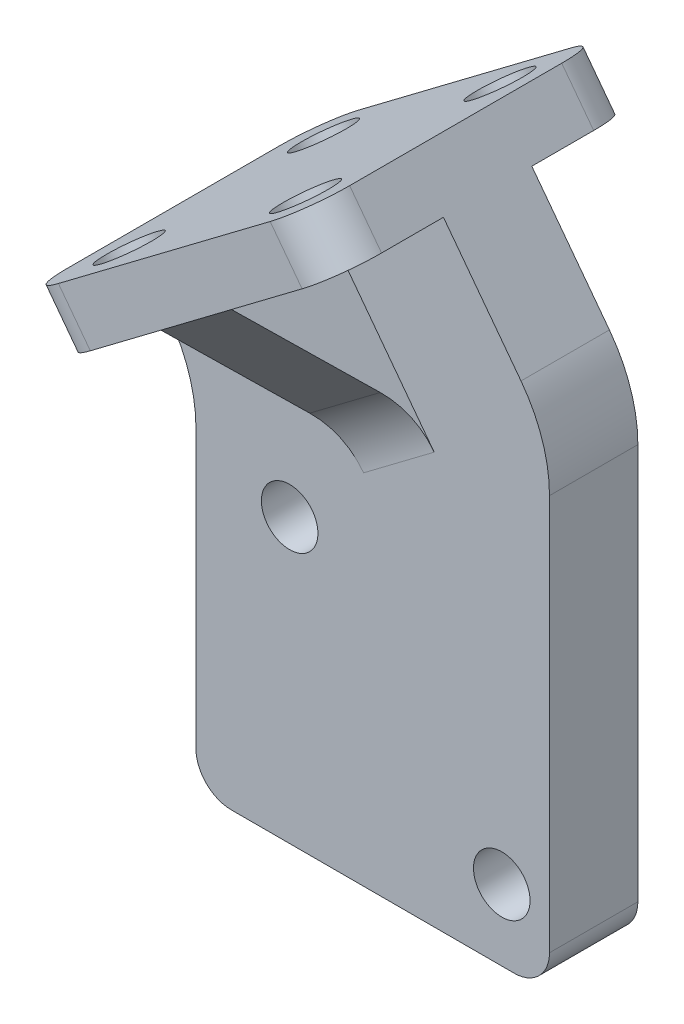
ISO-10303-21;
HEADER;
FILE_DESCRIPTION(('STEP AP214'),'2;1');
FILE_NAME('part.step','',(''),(''),'','','');
FILE_SCHEMA(('AUTOMOTIVE_DESIGN { 1 0 10303 214 1 1 1 1 }'));
ENDSEC;
DATA;
#1=APPLICATION_CONTEXT('core data for automotive mechanical design processes');
#2=APPLICATION_PROTOCOL_DEFINITION('international standard','automotive_design',2000,#1);
#3=PRODUCT_CONTEXT('',#1,'mechanical');
#4=PRODUCT('Part','Part','',(#3));
#5=PRODUCT_RELATED_PRODUCT_CATEGORY('part','',(#4));
#6=PRODUCT_DEFINITION_FORMATION('','',#4);
#7=PRODUCT_DEFINITION_CONTEXT('part definition',#1,'design');
#8=PRODUCT_DEFINITION('design','',#6,#7);
#9=PRODUCT_DEFINITION_SHAPE('','',#8);
#10=(LENGTH_UNIT() NAMED_UNIT(*) SI_UNIT(.MILLI.,.METRE.));
#11=(NAMED_UNIT(*) PLANE_ANGLE_UNIT() SI_UNIT($,.RADIAN.));
#12=(NAMED_UNIT(*) SI_UNIT($,.STERADIAN.) SOLID_ANGLE_UNIT());
#13=UNCERTAINTY_MEASURE_WITH_UNIT(LENGTH_MEASURE(1.E-05),#10,'distance_accuracy_value','');
#14=(GEOMETRIC_REPRESENTATION_CONTEXT(3) GLOBAL_UNCERTAINTY_ASSIGNED_CONTEXT((#13)) GLOBAL_UNIT_ASSIGNED_CONTEXT((#10,
#11,#12)) REPRESENTATION_CONTEXT('',''));
#15=CARTESIAN_POINT('',(0.,0.,0.));
#16=DIRECTION('',(0.,0.,1.));
#17=DIRECTION('',(1.,0.,0.));
#18=AXIS2_PLACEMENT_3D('',#15,#16,#17);
#19=CARTESIAN_POINT('',(0.023878574172298,24.5045375578801,8.5));
#20=DIRECTION('',(0.601815023152044,-0.798635510047296,0.));
#21=DIRECTION('',(0.798635510047296,0.601815023152044,0.));
#22=AXIS2_PLACEMENT_3D('',#19,#20,#21);
#23=PLANE('',#22);
#24=CARTESIAN_POINT('',(11.0051168373226,32.7794941262207,-3.));
#25=DIRECTION('',(-0.601815023152044,0.798635510047296,0.));
#26=DIRECTION('',(-0.798635510047296,-0.601815023152044,0.));
#27=AXIS2_PLACEMENT_3D('',#24,#25,#26);
#28=CIRCLE('',#27,1.60000000000001);
#29=CARTESIAN_POINT('',(9.72730002124695,31.8165900891774,-3.));
#30=VERTEX_POINT('',#29);
#31=EDGE_CURVE('E791',#30,#30,#28,.T.);
#32=ORIENTED_EDGE('',*,*,#31,.T.);
#33=EDGE_LOOP('',(#32));
#34=FACE_BOUND('',#33,.T.);
#35=DIRECTION('',(-0.798635510047296,-0.601815023152044,0.));
#36=VECTOR('',#35,1.);
#37=CARTESIAN_POINT('',(-1.97271020094593,23.,0.));
#38=LINE('',#37,#36);
#39=CARTESIAN_POINT('',(14.,35.0363004630409,0.));
#40=VERTEX_POINT('',#39);
#41=CARTESIAN_POINT('',(8.01023367464528,30.5226877894005,0.));
#42=VERTEX_POINT('',#41);
#43=EDGE_CURVE('E238',#40,#42,#38,.T.);
#44=ORIENTED_EDGE('',*,*,#43,.T.);
#45=DIRECTION('',(0.,0.,1.));
#46=VECTOR('',#45,1.);
#47=CARTESIAN_POINT('',(8.01023367464528,30.5226877894005,-6.));
#48=LINE('',#47,#46);
#49=CARTESIAN_POINT('',(8.01023367464528,30.5226877894005,-6.));
#50=VERTEX_POINT('',#49);
#51=EDGE_CURVE('E220',#50,#42,#48,.T.);
#52=ORIENTED_EDGE('',*,*,#51,.F.);
#53=DIRECTION('',(-0.798635510047296,-0.601815023152043,0.));
#54=VECTOR('',#53,1.);
#55=CARTESIAN_POINT('',(12.0034112248818,33.5317629051608,-6.));
#56=LINE('',#55,#54);
#57=CARTESIAN_POINT('',(12.0034112248818,33.5317629051608,-6.));
#58=VERTEX_POINT('',#57);
#59=EDGE_CURVE('E372',#58,#50,#56,.T.);
#60=ORIENTED_EDGE('',*,*,#59,.F.);
#61=CARTESIAN_POINT('',(12.0034112248818,33.5317629051608,-3.5));
#62=DIRECTION('',(-0.601815023152044,0.798635510047296,0.));
#63=DIRECTION('',(-0.798635510047296,-0.601815023152044,0.));
#64=AXIS2_PLACEMENT_3D('',#61,#62,#63);
#65=CIRCLE('',#64,2.5);
#66=CARTESIAN_POINT('',(14.,35.0363004630409,-3.5));
#67=VERTEX_POINT('',#66);
#68=EDGE_CURVE('E364',#67,#58,#65,.T.);
#69=ORIENTED_EDGE('',*,*,#68,.F.);
#70=DIRECTION('',(0.,0.,-1.));
#71=VECTOR('',#70,1.);
#72=CARTESIAN_POINT('',(14.,35.0363004630409,8.5));
#73=LINE('',#72,#71);
#74=EDGE_CURVE('E365',#40,#67,#73,.T.);
#75=ORIENTED_EDGE('',*,*,#74,.F.);
#76=EDGE_LOOP('',(#44,#52,#60,#69,#75));
#77=FACE_BOUND('',#76,.T.);
#78=ADVANCED_FACE('F35',(#34,#77),#23,.T.);
#79=CARTESIAN_POINT('',(12.,24.3972689773018,5.));
#80=DIRECTION('',(0.,0.,-1.));
#81=DIRECTION('',(-1.,0.,0.));
#82=AXIS2_PLACEMENT_3D('',#79,#80,#81);
#83=PLANE('',#82);
#84=CARTESIAN_POINT('',(17.3,4.,5.));
#85=DIRECTION('',(0.,0.,1.));
#86=DIRECTION('',(1.,0.,0.));
#87=AXIS2_PLACEMENT_3D('',#84,#85,#86);
#88=CIRCLE('',#87,1.6);
#89=CARTESIAN_POINT('',(18.9,4.,5.));
#90=VERTEX_POINT('',#89);
#91=EDGE_CURVE('E404',#90,#90,#88,.T.);
#92=ORIENTED_EDGE('',*,*,#91,.F.);
#93=EDGE_LOOP('',(#92));
#94=FACE_BOUND('',#93,.T.);
#95=CARTESIAN_POINT('',(5.3,16.,5.));
#96=DIRECTION('',(0.,0.,1.));
#97=DIRECTION('',(1.,0.,0.));
#98=AXIS2_PLACEMENT_3D('',#95,#96,#97);
#99=CIRCLE('',#98,1.6);
#100=CARTESIAN_POINT('',(6.9,16.,5.));
#101=VERTEX_POINT('',#100);
#102=EDGE_CURVE('E239',#101,#101,#99,.T.);
#103=ORIENTED_EDGE('',*,*,#102,.F.);
#104=EDGE_LOOP('',(#103));
#105=FACE_BOUND('',#104,.T.);
#106=DIRECTION('',(-0.601815023152044,0.798635510047296,0.));
#107=VECTOR('',#106,1.);
#108=CARTESIAN_POINT('',(8.01023367464528,30.5226877894005,5.));
#109=LINE('',#108,#107);
#110=CARTESIAN_POINT('',(13.4780280690126,23.2666795526702,5.));
#111=VERTEX_POINT('',#110);
#112=CARTESIAN_POINT('',(8.01023367464528,30.5226877894005,5.));
#113=VERTEX_POINT('',#112);
#114=EDGE_CURVE('E50',#111,#113,#109,.T.);
#115=ORIENTED_EDGE('',*,*,#114,.F.);
#116=DIRECTION('',(0.798635510047296,0.601815023152044,0.));
#117=VECTOR('',#116,1.);
#118=CARTESIAN_POINT('',(13.0787103139889,22.9657720410942,5.));
#119=LINE('',#118,#117);
#120=CARTESIAN_POINT('',(9.4848505187761,20.25760443691,5.));
#121=VERTEX_POINT('',#120);
#122=EDGE_CURVE('E299',#111,#121,#119,.F.);
#123=ORIENTED_EDGE('',*,*,#122,.T.);
#124=DIRECTION('',(-0.601815023152044,0.798635510047296,0.));
#125=VECTOR('',#124,1.);
#126=CARTESIAN_POINT('',(4.0170561244088,27.5136126736403,5.));
#127=LINE('',#126,#125);
#128=CARTESIAN_POINT('',(4.0170561244088,27.5136126736403,5.));
#129=VERTEX_POINT('',#128);
#130=EDGE_CURVE('E57',#121,#129,#127,.T.);
#131=ORIENTED_EDGE('',*,*,#130,.T.);
#132=DIRECTION('',(-0.798635510047296,-0.601815023152044,0.));
#133=VECTOR('',#132,1.);
#134=CARTESIAN_POINT('',(-1.97271020094593,23.,5.));
#135=LINE('',#134,#133);
#136=CARTESIAN_POINT('',(-1.97271020094593,23.,5.));
#137=VERTEX_POINT('',#136);
#138=EDGE_CURVE('E267',#129,#137,#135,.T.);
#139=ORIENTED_EDGE('',*,*,#138,.T.);
#140=DIRECTION('',(0.601815023152043,-0.798635510047297,0.));
#141=VECTOR('',#140,1.);
#142=CARTESIAN_POINT('',(-1.61091591962163,22.5198827724767,5.));
#143=LINE('',#142,#141);
#144=CARTESIAN_POINT('',(-1.61091591962163,22.5198827724767,5.));
#145=VERTEX_POINT('',#144);
#146=EDGE_CURVE('E329',#137,#145,#143,.T.);
#147=ORIENTED_EDGE('',*,*,#146,.T.);
#148=CARTESIAN_POINT('',(-8.,17.7053625872604,5.));
#149=DIRECTION('',(0.,0.,-1.));
#150=DIRECTION('',(1.,0.,0.));
#151=AXIS2_PLACEMENT_3D('',#148,#149,#150);
#152=CIRCLE('',#151,8.);
#153=CARTESIAN_POINT('',(0.,17.7053625872604,5.));
#154=VERTEX_POINT('',#153);
#155=EDGE_CURVE('E333',#145,#154,#152,.T.);
#156=ORIENTED_EDGE('',*,*,#155,.T.);
#157=DIRECTION('',(0.,-1.,0.));
#158=VECTOR('',#157,1.);
#159=CARTESIAN_POINT('',(0.,2.00000000000001,5.));
#160=LINE('',#159,#158);
#161=CARTESIAN_POINT('',(0.,2.00000000000001,5.));
#162=VERTEX_POINT('',#161);
#163=EDGE_CURVE('E335',#154,#162,#160,.T.);
#164=ORIENTED_EDGE('',*,*,#163,.T.);
#165=CARTESIAN_POINT('',(2.,2.,5.));
#166=DIRECTION('',(0.,0.,1.));
#167=DIRECTION('',(1.,0.,0.));
#168=AXIS2_PLACEMENT_3D('',#165,#166,#167);
#169=CIRCLE('',#168,2.);
#170=CARTESIAN_POINT('',(2.00000000000001,0.,5.));
#171=VERTEX_POINT('',#170);
#172=EDGE_CURVE('E337',#162,#171,#169,.T.);
#173=ORIENTED_EDGE('',*,*,#172,.T.);
#174=DIRECTION('',(1.,0.,0.));
#175=VECTOR('',#174,1.);
#176=CARTESIAN_POINT('',(18.,0.,5.));
#177=LINE('',#176,#175);
#178=CARTESIAN_POINT('',(18.,0.,5.));
#179=VERTEX_POINT('',#178);
#180=EDGE_CURVE('E339',#171,#179,#177,.T.);
#181=ORIENTED_EDGE('',*,*,#180,.T.);
#182=CARTESIAN_POINT('',(18.,2.,5.));
#183=DIRECTION('',(0.,0.,1.));
#184=DIRECTION('',(-1.,0.,0.));
#185=AXIS2_PLACEMENT_3D('',#182,#183,#184);
#186=CIRCLE('',#185,2.);
#187=CARTESIAN_POINT('',(20.,2.00000000000001,5.));
#188=VERTEX_POINT('',#187);
#189=EDGE_CURVE('E341',#179,#188,#186,.T.);
#190=ORIENTED_EDGE('',*,*,#189,.T.);
#191=DIRECTION('',(0.,1.,0.));
#192=VECTOR('',#191,1.);
#193=CARTESIAN_POINT('',(20.,24.3972689773018,5.));
#194=LINE('',#193,#192);
#195=CARTESIAN_POINT('',(20.,24.3972689773018,5.));
#196=VERTEX_POINT('',#195);
#197=EDGE_CURVE('E343',#188,#196,#194,.T.);
#198=ORIENTED_EDGE('',*,*,#197,.T.);
#199=CARTESIAN_POINT('',(12.,24.3972689773018,5.));
#200=DIRECTION('',(0.,0.,1.));
#201=DIRECTION('',(-1.,0.,0.));
#202=AXIS2_PLACEMENT_3D('',#199,#200,#201);
#203=CIRCLE('',#202,8.);
#204=CARTESIAN_POINT('',(18.3890840803784,29.2117891625181,5.));
#205=VERTEX_POINT('',#204);
#206=EDGE_CURVE('E344',#196,#205,#203,.T.);
#207=ORIENTED_EDGE('',*,*,#206,.T.);
#208=DIRECTION('',(-0.601815023152044,0.798635510047296,0.));
#209=VECTOR('',#208,1.);
#210=CARTESIAN_POINT('',(14.,35.0363004630409,5.));
#211=LINE('',#210,#209);
#212=CARTESIAN_POINT('',(14.,35.0363004630409,5.));
#213=VERTEX_POINT('',#212);
#214=EDGE_CURVE('E247',#205,#213,#211,.T.);
#215=ORIENTED_EDGE('',*,*,#214,.T.);
#216=EDGE_CURVE('E327',#213,#113,#135,.T.);
#217=ORIENTED_EDGE('',*,*,#216,.T.);
#218=EDGE_LOOP('',(#115,#123,#131,#139,#147,#156,#164,#173,#181,#190,#198,#207,#215,#217));
#219=FACE_BOUND('',#218,.T.);
#220=ADVANCED_FACE('F313',(#94,#105,#219),#83,.F.);
#221=CARTESIAN_POINT('',(1.02217296173143,25.2568063368202,8.));
#222=DIRECTION('',(-0.601815023152044,0.798635510047296,0.));
#223=DIRECTION('',(-0.798635510047296,-0.601815023152044,0.));
#224=AXIS2_PLACEMENT_3D('',#221,#222,#223);
#225=CIRCLE('',#224,1.6);
#226=CARTESIAN_POINT('',(-0.255643854344243,24.2939022997769,8.));
#227=VERTEX_POINT('',#226);
#228=EDGE_CURVE('E781',#227,#227,#225,.T.);
#229=ORIENTED_EDGE('',*,*,#228,.T.);
#230=EDGE_LOOP('',(#229));
#231=FACE_BOUND('',#230,.T.);
#232=ORIENTED_EDGE('',*,*,#138,.F.);
#233=DIRECTION('',(0.,0.,1.));
#234=VECTOR('',#233,1.);
#235=CARTESIAN_POINT('',(4.0170561244088,27.5136126736403,5.));
#236=LINE('',#235,#234);
#237=CARTESIAN_POINT('',(4.0170561244088,27.5136126736403,11.));
#238=VERTEX_POINT('',#237);
#239=EDGE_CURVE('E323',#129,#238,#236,.T.);
#240=ORIENTED_EDGE('',*,*,#239,.T.);
#241=DIRECTION('',(0.798635510047296,0.601815023152043,0.));
#242=VECTOR('',#241,1.);
#243=CARTESIAN_POINT('',(12.0034112248818,33.5317629051608,11.));
#244=LINE('',#243,#242);
#245=CARTESIAN_POINT('',(0.023878574172298,24.5045375578801,11.));
#246=VERTEX_POINT('',#245);
#247=EDGE_CURVE('E819',#246,#238,#244,.T.);
#248=ORIENTED_EDGE('',*,*,#247,.F.);
#249=CARTESIAN_POINT('',(0.023878574172298,24.5045375578801,8.5));
#250=DIRECTION('',(-0.601815023152044,0.798635510047296,0.));
#251=DIRECTION('',(0.798635510047296,0.601815023152044,0.));
#252=AXIS2_PLACEMENT_3D('',#249,#250,#251);
#253=CIRCLE('',#252,2.5);
#254=CARTESIAN_POINT('',(-1.97271020094594,23.,8.5));
#255=VERTEX_POINT('',#254);
#256=EDGE_CURVE('E802',#255,#246,#253,.T.);
#257=ORIENTED_EDGE('',*,*,#256,.F.);
#258=DIRECTION('',(0.,0.,1.));
#259=VECTOR('',#258,1.);
#260=CARTESIAN_POINT('',(-1.97271020094594,23.,8.5));
#261=LINE('',#260,#259);
#262=EDGE_CURVE('E326',#137,#255,#261,.T.);
#263=ORIENTED_EDGE('',*,*,#262,.F.);
#264=EDGE_LOOP('',(#232,#240,#248,#257,#263));
#265=FACE_BOUND('',#264,.T.);
#266=ADVANCED_FACE('F322',(#231,#265),#23,.T.);
#267=CARTESIAN_POINT('',(12.,24.3972689773018,0.));
#268=DIRECTION('',(0.,0.,-1.));
#269=DIRECTION('',(-1.,0.,0.));
#270=AXIS2_PLACEMENT_3D('',#267,#268,#269);
#271=PLANE('',#270);
#272=DIRECTION('',(0.798635510047296,0.601815023152044,0.));
#273=VECTOR('',#272,1.);
#274=CARTESIAN_POINT('',(13.4780280690126,23.2666795526702,0.));
#275=LINE('',#274,#273);
#276=CARTESIAN_POINT('',(9.4848505187761,20.25760443691,0.));
#277=VERTEX_POINT('',#276);
#278=CARTESIAN_POINT('',(13.4780280690126,23.2666795526702,0.));
#279=VERTEX_POINT('',#278);
#280=EDGE_CURVE('E292',#277,#279,#275,.T.);
#281=ORIENTED_EDGE('',*,*,#280,.T.);
#282=DIRECTION('',(0.601815023152044,-0.798635510047296,0.));
#283=VECTOR('',#282,1.);
#284=CARTESIAN_POINT('',(8.01023367464528,30.5226877894005,0.));
#285=LINE('',#284,#283);
#286=EDGE_CURVE('E832',#42,#279,#285,.T.);
#287=ORIENTED_EDGE('',*,*,#286,.F.);
#288=ORIENTED_EDGE('',*,*,#43,.F.);
#289=DIRECTION('',(-0.601815023152044,0.798635510047296,0.));
#290=VECTOR('',#289,1.);
#291=CARTESIAN_POINT('',(14.,35.0363004630409,0.));
#292=LINE('',#291,#290);
#293=CARTESIAN_POINT('',(18.3890840803784,29.2117891625181,0.));
#294=VERTEX_POINT('',#293);
#295=EDGE_CURVE('E264',#294,#40,#292,.T.);
#296=ORIENTED_EDGE('',*,*,#295,.F.);
#297=CARTESIAN_POINT('',(12.,24.3972689773018,0.));
#298=DIRECTION('',(0.,0.,1.));
#299=DIRECTION('',(-1.,0.,0.));
#300=AXIS2_PLACEMENT_3D('',#297,#298,#299);
#301=CIRCLE('',#300,8.);
#302=CARTESIAN_POINT('',(20.,24.3972689773018,0.));
#303=VERTEX_POINT('',#302);
#304=EDGE_CURVE('E262',#303,#294,#301,.T.);
#305=ORIENTED_EDGE('',*,*,#304,.F.);
#306=DIRECTION('',(0.,1.,0.));
#307=VECTOR('',#306,1.);
#308=CARTESIAN_POINT('',(20.,24.3972689773018,0.));
#309=LINE('',#308,#307);
#310=CARTESIAN_POINT('',(20.,2.00000000000001,0.));
#311=VERTEX_POINT('',#310);
#312=EDGE_CURVE('E260',#311,#303,#309,.T.);
#313=ORIENTED_EDGE('',*,*,#312,.F.);
#314=CARTESIAN_POINT('',(18.,2.,0.));
#315=DIRECTION('',(0.,0.,1.));
#316=DIRECTION('',(-1.,0.,0.));
#317=AXIS2_PLACEMENT_3D('',#314,#315,#316);
#318=CIRCLE('',#317,2.);
#319=CARTESIAN_POINT('',(18.,0.,0.));
#320=VERTEX_POINT('',#319);
#321=EDGE_CURVE('E258',#320,#311,#318,.T.);
#322=ORIENTED_EDGE('',*,*,#321,.F.);
#323=DIRECTION('',(1.,0.,0.));
#324=VECTOR('',#323,1.);
#325=CARTESIAN_POINT('',(18.,0.,0.));
#326=LINE('',#325,#324);
#327=CARTESIAN_POINT('',(2.00000000000001,0.,0.));
#328=VERTEX_POINT('',#327);
#329=EDGE_CURVE('E256',#328,#320,#326,.T.);
#330=ORIENTED_EDGE('',*,*,#329,.F.);
#331=CARTESIAN_POINT('',(2.,2.,0.));
#332=DIRECTION('',(0.,0.,1.));
#333=DIRECTION('',(1.,0.,0.));
#334=AXIS2_PLACEMENT_3D('',#331,#332,#333);
#335=CIRCLE('',#334,2.);
#336=CARTESIAN_POINT('',(0.,2.00000000000001,0.));
#337=VERTEX_POINT('',#336);
#338=EDGE_CURVE('E254',#337,#328,#335,.T.);
#339=ORIENTED_EDGE('',*,*,#338,.F.);
#340=DIRECTION('',(0.,-1.,0.));
#341=VECTOR('',#340,1.);
#342=CARTESIAN_POINT('',(0.,2.00000000000001,0.));
#343=LINE('',#342,#341);
#344=CARTESIAN_POINT('',(0.,17.7053625872604,0.));
#345=VERTEX_POINT('',#344);
#346=EDGE_CURVE('E252',#345,#337,#343,.T.);
#347=ORIENTED_EDGE('',*,*,#346,.F.);
#348=CARTESIAN_POINT('',(-8.,17.7053625872604,0.));
#349=DIRECTION('',(0.,0.,-1.));
#350=DIRECTION('',(1.,0.,0.));
#351=AXIS2_PLACEMENT_3D('',#348,#349,#350);
#352=CIRCLE('',#351,8.);
#353=CARTESIAN_POINT('',(-1.61091591962163,22.5198827724767,0.));
#354=VERTEX_POINT('',#353);
#355=EDGE_CURVE('E250',#354,#345,#352,.T.);
#356=ORIENTED_EDGE('',*,*,#355,.F.);
#357=DIRECTION('',(0.601815023152043,-0.798635510047297,0.));
#358=VECTOR('',#357,1.);
#359=CARTESIAN_POINT('',(-1.61091591962163,22.5198827724767,0.));
#360=LINE('',#359,#358);
#361=CARTESIAN_POINT('',(-1.97271020094593,23.,0.));
#362=VERTEX_POINT('',#361);
#363=EDGE_CURVE('E236',#362,#354,#360,.T.);
#364=ORIENTED_EDGE('',*,*,#363,.F.);
#365=CARTESIAN_POINT('',(4.0170561244088,27.5136126736403,0.));
#366=VERTEX_POINT('',#365);
#367=EDGE_CURVE('E226',#366,#362,#38,.T.);
#368=ORIENTED_EDGE('',*,*,#367,.F.);
#369=DIRECTION('',(0.601815023152044,-0.798635510047296,0.));
#370=VECTOR('',#369,1.);
#371=CARTESIAN_POINT('',(4.0170561244088,27.5136126736403,0.));
#372=LINE('',#371,#370);
#373=EDGE_CURVE('E207',#366,#277,#372,.T.);
#374=ORIENTED_EDGE('',*,*,#373,.T.);
#375=EDGE_LOOP('',(#281,#287,#288,#296,#305,#313,#322,#330,#339,#347,#356,#364,#368,#374));
#376=FACE_BOUND('',#375,.T.);
#377=CARTESIAN_POINT('',(5.3,16.,0.));
#378=DIRECTION('',(0.,0.,1.));
#379=DIRECTION('',(1.,0.,0.));
#380=AXIS2_PLACEMENT_3D('',#377,#378,#379);
#381=CIRCLE('',#380,1.6);
#382=CARTESIAN_POINT('',(6.9,16.,0.));
#383=VERTEX_POINT('',#382);
#384=EDGE_CURVE('E243',#383,#383,#381,.T.);
#385=ORIENTED_EDGE('',*,*,#384,.T.);
#386=EDGE_LOOP('',(#385));
#387=FACE_BOUND('',#386,.T.);
#388=CARTESIAN_POINT('',(17.3,4.,0.));
#389=DIRECTION('',(0.,0.,1.));
#390=DIRECTION('',(1.,0.,0.));
#391=AXIS2_PLACEMENT_3D('',#388,#389,#390);
#392=CIRCLE('',#391,1.6);
#393=CARTESIAN_POINT('',(18.9,4.,0.));
#394=VERTEX_POINT('',#393);
#395=EDGE_CURVE('E403',#394,#394,#392,.T.);
#396=ORIENTED_EDGE('',*,*,#395,.T.);
#397=EDGE_LOOP('',(#396));
#398=FACE_BOUND('',#397,.T.);
#399=ADVANCED_FACE('F233',(#376,#387,#398),#271,.T.);
#400=CARTESIAN_POINT('',(-1.61091591962163,22.5198827724767,5.));
#401=DIRECTION('',(0.798635510047297,0.601815023152043,0.));
#402=DIRECTION('',(-0.601815023152043,0.798635510047297,0.));
#403=AXIS2_PLACEMENT_3D('',#400,#401,#402);
#404=PLANE('',#403);
#405=ORIENTED_EDGE('',*,*,#363,.T.);
#406=DIRECTION('',(0.,0.,-1.));
#407=VECTOR('',#406,1.);
#408=CARTESIAN_POINT('',(-1.61091591962163,22.5198827724767,5.));
#409=LINE('',#408,#407);
#410=EDGE_CURVE('E289',#145,#354,#409,.T.);
#411=ORIENTED_EDGE('',*,*,#410,.F.);
#412=ORIENTED_EDGE('',*,*,#146,.F.);
#413=ORIENTED_EDGE('',*,*,#262,.T.);
#414=DIRECTION('',(0.601815023152043,-0.798635510047296,0.));
#415=VECTOR('',#414,1.);
#416=CARTESIAN_POINT('',(-3.77815527040207,25.3959065301419,8.5));
#417=LINE('',#416,#415);
#418=CARTESIAN_POINT('',(-3.77815527040207,25.3959065301419,8.5));
#419=VERTEX_POINT('',#418);
#420=EDGE_CURVE('E380',#419,#255,#417,.T.);
#421=ORIENTED_EDGE('',*,*,#420,.F.);
#422=DIRECTION('',(0.,0.,1.));
#423=VECTOR('',#422,1.);
#424=CARTESIAN_POINT('',(-3.77815527040207,25.3959065301419,8.5));
#425=LINE('',#424,#423);
#426=CARTESIAN_POINT('',(-3.77815527040207,25.3959065301419,-3.5));
#427=VERTEX_POINT('',#426);
#428=EDGE_CURVE('E384',#427,#419,#425,.T.);
#429=ORIENTED_EDGE('',*,*,#428,.F.);
#430=DIRECTION('',(0.601815023152043,-0.798635510047296,0.));
#431=VECTOR('',#430,1.);
#432=CARTESIAN_POINT('',(-3.77815527040207,25.3959065301419,-3.5));
#433=LINE('',#432,#431);
#434=CARTESIAN_POINT('',(-1.97271020094594,23.,-3.5));
#435=VERTEX_POINT('',#434);
#436=EDGE_CURVE('E383',#427,#435,#433,.T.);
#437=ORIENTED_EDGE('',*,*,#436,.T.);
#438=EDGE_CURVE('E377',#435,#362,#261,.T.);
#439=ORIENTED_EDGE('',*,*,#438,.T.);
#440=EDGE_LOOP('',(#405,#411,#412,#413,#421,#429,#437,#439));
#441=FACE_BOUND('',#440,.T.);
#442=ADVANCED_FACE('F646',(#441),#404,.F.);
#443=CARTESIAN_POINT('',(-8.,17.7053625872604,5.));
#444=DIRECTION('',(0.,0.,-1.));
#445=DIRECTION('',(-1.,0.,0.));
#446=AXIS2_PLACEMENT_3D('',#443,#444,#445);
#447=CYLINDRICAL_SURFACE('',#446,8.);
#448=ORIENTED_EDGE('',*,*,#355,.T.);
#449=DIRECTION('',(0.,0.,-1.));
#450=VECTOR('',#449,1.);
#451=CARTESIAN_POINT('',(0.,17.7053625872604,5.));
#452=LINE('',#451,#450);
#453=EDGE_CURVE('E286',#154,#345,#452,.T.);
#454=ORIENTED_EDGE('',*,*,#453,.F.);
#455=ORIENTED_EDGE('',*,*,#155,.F.);
#456=ORIENTED_EDGE('',*,*,#410,.T.);
#457=EDGE_LOOP('',(#448,#454,#455,#456));
#458=FACE_BOUND('',#457,.T.);
#459=ADVANCED_FACE('F652',(#458),#447,.F.);
#460=CARTESIAN_POINT('',(0.,2.00000000000001,5.));
#461=DIRECTION('',(1.,0.,0.));
#462=DIRECTION('',(0.,1.,0.));
#463=AXIS2_PLACEMENT_3D('',#460,#461,#462);
#464=PLANE('',#463);
#465=ORIENTED_EDGE('',*,*,#346,.T.);
#466=DIRECTION('',(0.,0.,-1.));
#467=VECTOR('',#466,1.);
#468=CARTESIAN_POINT('',(0.,2.00000000000001,5.));
#469=LINE('',#468,#467);
#470=EDGE_CURVE('E283',#162,#337,#469,.T.);
#471=ORIENTED_EDGE('',*,*,#470,.F.);
#472=ORIENTED_EDGE('',*,*,#163,.F.);
#473=ORIENTED_EDGE('',*,*,#453,.T.);
#474=EDGE_LOOP('',(#465,#471,#472,#473));
#475=FACE_BOUND('',#474,.T.);
#476=ADVANCED_FACE('F712',(#475),#464,.F.);
#477=CARTESIAN_POINT('',(2.,2.,5.));
#478=DIRECTION('',(0.,0.,-1.));
#479=DIRECTION('',(-1.,0.,0.));
#480=AXIS2_PLACEMENT_3D('',#477,#478,#479);
#481=CYLINDRICAL_SURFACE('',#480,2.);
#482=ORIENTED_EDGE('',*,*,#338,.T.);
#483=DIRECTION('',(0.,0.,-1.));
#484=VECTOR('',#483,1.);
#485=CARTESIAN_POINT('',(2.00000000000001,0.,5.));
#486=LINE('',#485,#484);
#487=EDGE_CURVE('E280',#171,#328,#486,.T.);
#488=ORIENTED_EDGE('',*,*,#487,.F.);
#489=ORIENTED_EDGE('',*,*,#172,.F.);
#490=ORIENTED_EDGE('',*,*,#470,.T.);
#491=EDGE_LOOP('',(#482,#488,#489,#490));
#492=FACE_BOUND('',#491,.T.);
#493=ADVANCED_FACE('F702',(#492),#481,.T.);
#494=CARTESIAN_POINT('',(18.,0.,5.));
#495=DIRECTION('',(0.,1.,0.));
#496=DIRECTION('',(0.,0.,1.));
#497=AXIS2_PLACEMENT_3D('',#494,#495,#496);
#498=PLANE('',#497);
#499=ORIENTED_EDGE('',*,*,#329,.T.);
#500=DIRECTION('',(0.,0.,-1.));
#501=VECTOR('',#500,1.);
#502=CARTESIAN_POINT('',(18.,0.,5.));
#503=LINE('',#502,#501);
#504=EDGE_CURVE('E277',#179,#320,#503,.T.);
#505=ORIENTED_EDGE('',*,*,#504,.F.);
#506=ORIENTED_EDGE('',*,*,#180,.F.);
#507=ORIENTED_EDGE('',*,*,#487,.T.);
#508=EDGE_LOOP('',(#499,#505,#506,#507));
#509=FACE_BOUND('',#508,.T.);
#510=ADVANCED_FACE('F692',(#509),#498,.F.);
#511=CARTESIAN_POINT('',(18.,2.,5.));
#512=DIRECTION('',(0.,0.,-1.));
#513=DIRECTION('',(-1.,0.,0.));
#514=AXIS2_PLACEMENT_3D('',#511,#512,#513);
#515=CYLINDRICAL_SURFACE('',#514,2.);
#516=ORIENTED_EDGE('',*,*,#321,.T.);
#517=DIRECTION('',(0.,0.,-1.));
#518=VECTOR('',#517,1.);
#519=CARTESIAN_POINT('',(20.,2.00000000000001,5.));
#520=LINE('',#519,#518);
#521=EDGE_CURVE('E274',#188,#311,#520,.T.);
#522=ORIENTED_EDGE('',*,*,#521,.F.);
#523=ORIENTED_EDGE('',*,*,#189,.F.);
#524=ORIENTED_EDGE('',*,*,#504,.T.);
#525=EDGE_LOOP('',(#516,#522,#523,#524));
#526=FACE_BOUND('',#525,.T.);
#527=ADVANCED_FACE('F682',(#526),#515,.T.);
#528=CARTESIAN_POINT('',(20.,24.3972689773018,5.));
#529=DIRECTION('',(-1.,0.,0.));
#530=DIRECTION('',(0.,-1.,0.));
#531=AXIS2_PLACEMENT_3D('',#528,#529,#530);
#532=PLANE('',#531);
#533=ORIENTED_EDGE('',*,*,#312,.T.);
#534=DIRECTION('',(0.,0.,-1.));
#535=VECTOR('',#534,1.);
#536=CARTESIAN_POINT('',(20.,24.3972689773018,5.));
#537=LINE('',#536,#535);
#538=EDGE_CURVE('E271',#196,#303,#537,.T.);
#539=ORIENTED_EDGE('',*,*,#538,.F.);
#540=ORIENTED_EDGE('',*,*,#197,.F.);
#541=ORIENTED_EDGE('',*,*,#521,.T.);
#542=EDGE_LOOP('',(#533,#539,#540,#541));
#543=FACE_BOUND('',#542,.T.);
#544=ADVANCED_FACE('F672',(#543),#532,.F.);
#545=CARTESIAN_POINT('',(12.,24.3972689773018,5.));
#546=DIRECTION('',(0.,0.,-1.));
#547=DIRECTION('',(-1.,0.,0.));
#548=AXIS2_PLACEMENT_3D('',#545,#546,#547);
#549=CYLINDRICAL_SURFACE('',#548,8.);
#550=ORIENTED_EDGE('',*,*,#304,.T.);
#551=DIRECTION('',(0.,0.,-1.));
#552=VECTOR('',#551,1.);
#553=CARTESIAN_POINT('',(18.3890840803784,29.2117891625181,5.));
#554=LINE('',#553,#552);
#555=EDGE_CURVE('E268',#205,#294,#554,.T.);
#556=ORIENTED_EDGE('',*,*,#555,.F.);
#557=ORIENTED_EDGE('',*,*,#206,.F.);
#558=ORIENTED_EDGE('',*,*,#538,.T.);
#559=EDGE_LOOP('',(#550,#556,#557,#558));
#560=FACE_BOUND('',#559,.T.);
#561=ADVANCED_FACE('F638',(#560),#549,.T.);
#562=CARTESIAN_POINT('',(14.,35.0363004630409,5.));
#563=DIRECTION('',(-0.798635510047296,-0.601815023152044,0.));
#564=DIRECTION('',(0.601815023152044,-0.798635510047296,0.));
#565=AXIS2_PLACEMENT_3D('',#562,#563,#564);
#566=PLANE('',#565);
#567=ORIENTED_EDGE('',*,*,#295,.T.);
#568=ORIENTED_EDGE('',*,*,#74,.T.);
#569=DIRECTION('',(0.601815023152043,-0.798635510047296,0.));
#570=VECTOR('',#569,1.);
#571=CARTESIAN_POINT('',(12.1945549305439,37.4322069931828,-3.5));
#572=LINE('',#571,#570);
#573=CARTESIAN_POINT('',(12.1945549305439,37.4322069931828,-3.5));
#574=VERTEX_POINT('',#573);
#575=EDGE_CURVE('E393',#574,#67,#572,.T.);
#576=ORIENTED_EDGE('',*,*,#575,.F.);
#577=DIRECTION('',(0.,0.,-1.));
#578=VECTOR('',#577,1.);
#579=CARTESIAN_POINT('',(12.1945549305439,37.4322069931828,8.5));
#580=LINE('',#579,#578);
#581=CARTESIAN_POINT('',(12.1945549305439,37.4322069931828,8.5));
#582=VERTEX_POINT('',#581);
#583=EDGE_CURVE('E810',#582,#574,#580,.T.);
#584=ORIENTED_EDGE('',*,*,#583,.F.);
#585=DIRECTION('',(0.601815023152043,-0.798635510047296,0.));
#586=VECTOR('',#585,1.);
#587=CARTESIAN_POINT('',(12.1945549305439,37.4322069931828,8.5));
#588=LINE('',#587,#586);
#589=CARTESIAN_POINT('',(14.,35.0363004630409,8.5));
#590=VERTEX_POINT('',#589);
#591=EDGE_CURVE('E363',#582,#590,#588,.T.);
#592=ORIENTED_EDGE('',*,*,#591,.T.);
#593=EDGE_CURVE('E356',#590,#213,#73,.T.);
#594=ORIENTED_EDGE('',*,*,#593,.T.);
#595=ORIENTED_EDGE('',*,*,#214,.F.);
#596=ORIENTED_EDGE('',*,*,#555,.T.);
#597=EDGE_LOOP('',(#567,#568,#576,#584,#592,#594,#595,#596));
#598=FACE_BOUND('',#597,.T.);
#599=ADVANCED_FACE('F360',(#598),#566,.F.);
#600=CARTESIAN_POINT('',(5.3,16.,5.));
#601=DIRECTION('',(0.,0.,-1.));
#602=DIRECTION('',(-1.,0.,0.));
#603=AXIS2_PLACEMENT_3D('',#600,#601,#602);
#604=CYLINDRICAL_SURFACE('',#603,1.6);
#605=ORIENTED_EDGE('',*,*,#102,.T.);
#606=EDGE_LOOP('',(#605));
#607=FACE_BOUND('',#606,.T.);
#608=ORIENTED_EDGE('',*,*,#384,.F.);
#609=EDGE_LOOP('',(#608));
#610=FACE_BOUND('',#609,.T.);
#611=ADVANCED_FACE('F413',(#607,#610),#604,.F.);
#612=CARTESIAN_POINT('',(17.3,4.,5.));
#613=DIRECTION('',(0.,0.,-1.));
#614=DIRECTION('',(-1.,0.,0.));
#615=AXIS2_PLACEMENT_3D('',#612,#613,#614);
#616=CYLINDRICAL_SURFACE('',#615,1.6);
#617=ORIENTED_EDGE('',*,*,#91,.T.);
#618=EDGE_LOOP('',(#617));
#619=FACE_BOUND('',#618,.T.);
#620=ORIENTED_EDGE('',*,*,#395,.F.);
#621=EDGE_LOOP('',(#620));
#622=FACE_BOUND('',#621,.T.);
#623=ADVANCED_FACE('F411',(#619,#622),#616,.F.);
#624=DIRECTION('',(0.,0.,1.));
#625=VECTOR('',#624,1.);
#626=CARTESIAN_POINT('',(8.01023367464528,30.5226877894005,5.));
#627=LINE('',#626,#625);
#628=CARTESIAN_POINT('',(8.01023367464528,30.5226877894005,11.));
#629=VERTEX_POINT('',#628);
#630=EDGE_CURVE('E358',#113,#629,#627,.T.);
#631=ORIENTED_EDGE('',*,*,#630,.F.);
#632=ORIENTED_EDGE('',*,*,#216,.F.);
#633=ORIENTED_EDGE('',*,*,#593,.F.);
#634=CARTESIAN_POINT('',(12.0034112248818,33.5317629051608,8.5));
#635=DIRECTION('',(-0.601815023152044,0.798635510047296,0.));
#636=DIRECTION('',(-0.798635510047296,-0.601815023152044,0.));
#637=AXIS2_PLACEMENT_3D('',#634,#635,#636);
#638=CIRCLE('',#637,2.5);
#639=CARTESIAN_POINT('',(12.0034112248818,33.5317629051608,11.));
#640=VERTEX_POINT('',#639);
#641=EDGE_CURVE('E368',#640,#590,#638,.T.);
#642=ORIENTED_EDGE('',*,*,#641,.F.);
#643=EDGE_CURVE('E818',#629,#640,#244,.T.);
#644=ORIENTED_EDGE('',*,*,#643,.F.);
#645=EDGE_LOOP('',(#631,#632,#633,#642,#644));
#646=FACE_BOUND('',#645,.T.);
#647=CARTESIAN_POINT('',(11.0051168373226,32.7794941262207,8.));
#648=DIRECTION('',(-0.601815023152044,0.798635510047296,0.));
#649=DIRECTION('',(-0.798635510047296,-0.601815023152044,0.));
#650=AXIS2_PLACEMENT_3D('',#647,#648,#649);
#651=CIRCLE('',#650,1.60000000000001);
#652=CARTESIAN_POINT('',(9.72730002124695,31.8165900891774,8.));
#653=VERTEX_POINT('',#652);
#654=EDGE_CURVE('E785',#653,#653,#651,.T.);
#655=ORIENTED_EDGE('',*,*,#654,.T.);
#656=EDGE_LOOP('',(#655));
#657=FACE_BOUND('',#656,.T.);
#658=ADVANCED_FACE('F353',(#646,#657),#23,.T.);
#659=CARTESIAN_POINT('',(-1.78156649528383,26.900444088022,8.5));
#660=DIRECTION('',(0.601815023152044,-0.798635510047296,0.));
#661=DIRECTION('',(0.798635510047296,0.601815023152044,0.));
#662=AXIS2_PLACEMENT_3D('',#659,#660,#661);
#663=PLANE('',#662);
#664=CARTESIAN_POINT('',(-1.78156649528383,26.900444088022,8.5));
#665=DIRECTION('',(-0.601815023152044,0.798635510047296,0.));
#666=DIRECTION('',(0.798635510047296,0.601815023152044,0.));
#667=AXIS2_PLACEMENT_3D('',#664,#665,#666);
#668=CIRCLE('',#667,2.5);
#669=CARTESIAN_POINT('',(-1.78156649528383,26.900444088022,11.));
#670=VERTEX_POINT('',#669);
#671=EDGE_CURVE('E379',#419,#670,#668,.T.);
#672=ORIENTED_EDGE('',*,*,#671,.T.);
#673=DIRECTION('',(0.798635510047296,0.601815023152043,0.));
#674=VECTOR('',#673,1.);
#675=CARTESIAN_POINT('',(10.1979661554256,35.9276694353027,11.));
#676=LINE('',#675,#674);
#677=CARTESIAN_POINT('',(10.1979661554256,35.9276694353027,11.));
#678=VERTEX_POINT('',#677);
#679=EDGE_CURVE('E806',#670,#678,#676,.T.);
#680=ORIENTED_EDGE('',*,*,#679,.T.);
#681=CARTESIAN_POINT('',(10.1979661554256,35.9276694353027,8.5));
#682=DIRECTION('',(-0.601815023152044,0.798635510047296,0.));
#683=DIRECTION('',(-0.798635510047296,-0.601815023152044,0.));
#684=AXIS2_PLACEMENT_3D('',#681,#682,#683);
#685=CIRCLE('',#684,2.5);
#686=EDGE_CURVE('E808',#678,#582,#685,.T.);
#687=ORIENTED_EDGE('',*,*,#686,.T.);
#688=ORIENTED_EDGE('',*,*,#583,.T.);
#689=CARTESIAN_POINT('',(10.1979661554256,35.9276694353027,-3.5));
#690=DIRECTION('',(-0.601815023152044,0.798635510047296,0.));
#691=DIRECTION('',(-0.798635510047296,-0.601815023152044,0.));
#692=AXIS2_PLACEMENT_3D('',#689,#690,#691);
#693=CIRCLE('',#692,2.5);
#694=CARTESIAN_POINT('',(10.1979661554256,35.9276694353027,-6.));
#695=VERTEX_POINT('',#694);
#696=EDGE_CURVE('E812',#574,#695,#693,.T.);
#697=ORIENTED_EDGE('',*,*,#696,.T.);
#698=DIRECTION('',(-0.798635510047296,-0.601815023152043,0.));
#699=VECTOR('',#698,1.);
#700=CARTESIAN_POINT('',(10.1979661554256,35.9276694353027,-6.));
#701=LINE('',#700,#699);
#702=CARTESIAN_POINT('',(-1.78156649528383,26.900444088022,-6.));
#703=VERTEX_POINT('',#702);
#704=EDGE_CURVE('E764',#695,#703,#701,.T.);
#705=ORIENTED_EDGE('',*,*,#704,.T.);
#706=CARTESIAN_POINT('',(-1.78156649528383,26.900444088022,-3.5));
#707=DIRECTION('',(-0.601815023152044,0.798635510047296,0.));
#708=DIRECTION('',(-0.798635510047296,-0.601815023152044,0.));
#709=AXIS2_PLACEMENT_3D('',#706,#707,#708);
#710=CIRCLE('',#709,2.5);
#711=EDGE_CURVE('E762',#703,#427,#710,.T.);
#712=ORIENTED_EDGE('',*,*,#711,.T.);
#713=ORIENTED_EDGE('',*,*,#428,.T.);
#714=EDGE_LOOP('',(#672,#680,#687,#688,#697,#705,#712,#713));
#715=FACE_BOUND('',#714,.T.);
#716=CARTESIAN_POINT('',(-0.783272107724699,27.6527128669621,-3.));
#717=DIRECTION('',(-0.601815023152044,0.798635510047296,0.));
#718=DIRECTION('',(-0.798635510047296,-0.601815023152044,0.));
#719=AXIS2_PLACEMENT_3D('',#716,#717,#718);
#720=CIRCLE('',#719,1.6);
#721=CARTESIAN_POINT('',(-2.06108892380037,26.6898088299188,-3.));
#722=VERTEX_POINT('',#721);
#723=EDGE_CURVE('E799',#722,#722,#720,.T.);
#724=ORIENTED_EDGE('',*,*,#723,.F.);
#725=EDGE_LOOP('',(#724));
#726=FACE_BOUND('',#725,.T.);
#727=CARTESIAN_POINT('',(9.19967176786651,35.1754006563626,-3.));
#728=DIRECTION('',(-0.601815023152044,0.798635510047296,0.));
#729=DIRECTION('',(-0.798635510047296,-0.601815023152044,0.));
#730=AXIS2_PLACEMENT_3D('',#727,#728,#729);
#731=CIRCLE('',#730,1.60000000000001);
#732=CARTESIAN_POINT('',(7.92185495179082,34.2124966193193,-3.));
#733=VERTEX_POINT('',#732);
#734=EDGE_CURVE('E794',#733,#733,#731,.T.);
#735=ORIENTED_EDGE('',*,*,#734,.F.);
#736=EDGE_LOOP('',(#735));
#737=FACE_BOUND('',#736,.T.);
#738=CARTESIAN_POINT('',(9.19967176786651,35.1754006563626,8.));
#739=DIRECTION('',(-0.601815023152044,0.798635510047296,0.));
#740=DIRECTION('',(-0.798635510047296,-0.601815023152044,0.));
#741=AXIS2_PLACEMENT_3D('',#738,#739,#740);
#742=CIRCLE('',#741,1.60000000000001);
#743=CARTESIAN_POINT('',(7.92185495179082,34.2124966193193,8.));
#744=VERTEX_POINT('',#743);
#745=EDGE_CURVE('E788',#744,#744,#742,.T.);
#746=ORIENTED_EDGE('',*,*,#745,.F.);
#747=EDGE_LOOP('',(#746));
#748=FACE_BOUND('',#747,.T.);
#749=CARTESIAN_POINT('',(-0.783272107724699,27.6527128669621,8.));
#750=DIRECTION('',(-0.601815023152044,0.798635510047296,0.));
#751=DIRECTION('',(-0.798635510047296,-0.601815023152044,0.));
#752=AXIS2_PLACEMENT_3D('',#749,#750,#751);
#753=CIRCLE('',#752,1.6);
#754=CARTESIAN_POINT('',(-2.06108892380037,26.6898088299188,8.));
#755=VERTEX_POINT('',#754);
#756=EDGE_CURVE('E782',#755,#755,#753,.T.);
#757=ORIENTED_EDGE('',*,*,#756,.F.);
#758=EDGE_LOOP('',(#757));
#759=FACE_BOUND('',#758,.T.);
#760=ADVANCED_FACE('F420',(#715,#726,#737,#748,#759),#663,.F.);
#761=DIRECTION('',(0.,0.,1.));
#762=VECTOR('',#761,1.);
#763=CARTESIAN_POINT('',(4.0170561244088,27.5136126736403,-6.));
#764=LINE('',#763,#762);
#765=CARTESIAN_POINT('',(4.01705612440879,27.5136126736403,-6.));
#766=VERTEX_POINT('',#765);
#767=EDGE_CURVE('E211',#766,#366,#764,.T.);
#768=ORIENTED_EDGE('',*,*,#767,.T.);
#769=ORIENTED_EDGE('',*,*,#367,.T.);
#770=ORIENTED_EDGE('',*,*,#438,.F.);
#771=CARTESIAN_POINT('',(0.023878574172298,24.5045375578801,-3.5));
#772=DIRECTION('',(-0.601815023152044,0.798635510047296,0.));
#773=DIRECTION('',(-0.798635510047296,-0.601815023152044,0.));
#774=AXIS2_PLACEMENT_3D('',#771,#772,#773);
#775=CIRCLE('',#774,2.5);
#776=CARTESIAN_POINT('',(0.023878574172298,24.5045375578801,-6.));
#777=VERTEX_POINT('',#776);
#778=EDGE_CURVE('E375',#777,#435,#775,.T.);
#779=ORIENTED_EDGE('',*,*,#778,.F.);
#780=EDGE_CURVE('E229',#766,#777,#56,.T.);
#781=ORIENTED_EDGE('',*,*,#780,.F.);
#782=EDGE_LOOP('',(#768,#769,#770,#779,#781));
#783=FACE_BOUND('',#782,.T.);
#784=CARTESIAN_POINT('',(1.02217296173143,25.2568063368202,-3.));
#785=DIRECTION('',(-0.601815023152044,0.798635510047296,0.));
#786=DIRECTION('',(-0.798635510047296,-0.601815023152044,0.));
#787=AXIS2_PLACEMENT_3D('',#784,#785,#786);
#788=CIRCLE('',#787,1.6);
#789=CARTESIAN_POINT('',(-0.255643854344243,24.2939022997769,-3.));
#790=VERTEX_POINT('',#789);
#791=EDGE_CURVE('E797',#790,#790,#788,.T.);
#792=ORIENTED_EDGE('',*,*,#791,.T.);
#793=EDGE_LOOP('',(#792));
#794=FACE_BOUND('',#793,.T.);
#795=ADVANCED_FACE('F223',(#783,#794),#23,.T.);
#796=CARTESIAN_POINT('',(-1.78156649528383,26.900444088022,8.5));
#797=DIRECTION('',(0.601815023152043,-0.798635510047296,0.));
#798=DIRECTION('',(0.798635510047296,0.601815023152044,0.));
#799=AXIS2_PLACEMENT_3D('',#796,#797,#798);
#800=CYLINDRICAL_SURFACE('',#799,2.5);
#801=ORIENTED_EDGE('',*,*,#256,.T.);
#802=DIRECTION('',(0.601815023152043,-0.798635510047296,0.));
#803=VECTOR('',#802,1.);
#804=CARTESIAN_POINT('',(-1.78156649528383,26.900444088022,11.));
#805=LINE('',#804,#803);
#806=EDGE_CURVE('E400',#670,#246,#805,.T.);
#807=ORIENTED_EDGE('',*,*,#806,.F.);
#808=ORIENTED_EDGE('',*,*,#671,.F.);
#809=ORIENTED_EDGE('',*,*,#420,.T.);
#810=EDGE_LOOP('',(#801,#807,#808,#809));
#811=FACE_BOUND('',#810,.T.);
#812=ADVANCED_FACE('F439',(#811),#800,.T.);
#813=CARTESIAN_POINT('',(10.1979661554256,35.9276694353027,11.));
#814=DIRECTION('',(0.,0.,-1.));
#815=DIRECTION('',(-1.,0.,0.));
#816=AXIS2_PLACEMENT_3D('',#813,#814,#815);
#817=PLANE('',#816);
#818=ORIENTED_EDGE('',*,*,#247,.T.);
#819=DIRECTION('',(0.798635510047296,0.601815023152044,0.));
#820=VECTOR('',#819,1.);
#821=CARTESIAN_POINT('',(4.0170561244088,27.5136126736403,11.));
#822=LINE('',#821,#820);
#823=EDGE_CURVE('E316',#238,#629,#822,.T.);
#824=ORIENTED_EDGE('',*,*,#823,.T.);
#825=ORIENTED_EDGE('',*,*,#643,.T.);
#826=DIRECTION('',(0.601815023152043,-0.798635510047296,0.));
#827=VECTOR('',#826,1.);
#828=CARTESIAN_POINT('',(10.1979661554256,35.9276694353027,11.));
#829=LINE('',#828,#827);
#830=EDGE_CURVE('E397',#678,#640,#829,.T.);
#831=ORIENTED_EDGE('',*,*,#830,.F.);
#832=ORIENTED_EDGE('',*,*,#679,.F.);
#833=ORIENTED_EDGE('',*,*,#806,.T.);
#834=EDGE_LOOP('',(#818,#824,#825,#831,#832,#833));
#835=FACE_BOUND('',#834,.T.);
#836=ADVANCED_FACE('F444',(#835),#817,.F.);
#837=CARTESIAN_POINT('',(10.1979661554256,35.9276694353027,8.5));
#838=DIRECTION('',(0.601815023152043,-0.798635510047296,0.));
#839=DIRECTION('',(0.798635510047296,0.601815023152044,0.));
#840=AXIS2_PLACEMENT_3D('',#837,#838,#839);
#841=CYLINDRICAL_SURFACE('',#840,2.5);
#842=ORIENTED_EDGE('',*,*,#641,.T.);
#843=ORIENTED_EDGE('',*,*,#591,.F.);
#844=ORIENTED_EDGE('',*,*,#686,.F.);
#845=ORIENTED_EDGE('',*,*,#830,.T.);
#846=EDGE_LOOP('',(#842,#843,#844,#845));
#847=FACE_BOUND('',#846,.T.);
#848=ADVANCED_FACE('F596',(#847),#841,.T.);
#849=CARTESIAN_POINT('',(10.1979661554256,35.9276694353027,-3.5));
#850=DIRECTION('',(0.601815023152043,-0.798635510047296,0.));
#851=DIRECTION('',(0.798635510047296,0.601815023152044,0.));
#852=AXIS2_PLACEMENT_3D('',#849,#850,#851);
#853=CYLINDRICAL_SURFACE('',#852,2.5);
#854=ORIENTED_EDGE('',*,*,#68,.T.);
#855=DIRECTION('',(0.601815023152043,-0.798635510047296,0.));
#856=VECTOR('',#855,1.);
#857=CARTESIAN_POINT('',(10.1979661554256,35.9276694353027,-6.));
#858=LINE('',#857,#856);
#859=EDGE_CURVE('E390',#695,#58,#858,.T.);
#860=ORIENTED_EDGE('',*,*,#859,.F.);
#861=ORIENTED_EDGE('',*,*,#696,.F.);
#862=ORIENTED_EDGE('',*,*,#575,.T.);
#863=EDGE_LOOP('',(#854,#860,#861,#862));
#864=FACE_BOUND('',#863,.T.);
#865=ADVANCED_FACE('F587',(#864),#853,.T.);
#866=CARTESIAN_POINT('',(10.1979661554256,35.9276694353027,-6.));
#867=DIRECTION('',(0.,0.,1.));
#868=DIRECTION('',(1.,0.,0.));
#869=AXIS2_PLACEMENT_3D('',#866,#867,#868);
#870=PLANE('',#869);
#871=ORIENTED_EDGE('',*,*,#59,.T.);
#872=DIRECTION('',(0.798635510047296,0.601815023152044,0.));
#873=VECTOR('',#872,1.);
#874=CARTESIAN_POINT('',(4.0170561244088,27.5136126736403,-6.));
#875=LINE('',#874,#873);
#876=EDGE_CURVE('E231',#766,#50,#875,.T.);
#877=ORIENTED_EDGE('',*,*,#876,.F.);
#878=ORIENTED_EDGE('',*,*,#780,.T.);
#879=DIRECTION('',(0.601815023152043,-0.798635510047296,0.));
#880=VECTOR('',#879,1.);
#881=CARTESIAN_POINT('',(-1.78156649528383,26.900444088022,-6.));
#882=LINE('',#881,#880);
#883=EDGE_CURVE('E387',#703,#777,#882,.T.);
#884=ORIENTED_EDGE('',*,*,#883,.F.);
#885=ORIENTED_EDGE('',*,*,#704,.F.);
#886=ORIENTED_EDGE('',*,*,#859,.T.);
#887=EDGE_LOOP('',(#871,#877,#878,#884,#885,#886));
#888=FACE_BOUND('',#887,.T.);
#889=ADVANCED_FACE('F579',(#888),#870,.F.);
#890=CARTESIAN_POINT('',(-1.78156649528383,26.900444088022,-3.5));
#891=DIRECTION('',(0.601815023152043,-0.798635510047296,0.));
#892=DIRECTION('',(0.798635510047296,0.601815023152044,0.));
#893=AXIS2_PLACEMENT_3D('',#890,#891,#892);
#894=CYLINDRICAL_SURFACE('',#893,2.5);
#895=ORIENTED_EDGE('',*,*,#778,.T.);
#896=ORIENTED_EDGE('',*,*,#436,.F.);
#897=ORIENTED_EDGE('',*,*,#711,.F.);
#898=ORIENTED_EDGE('',*,*,#883,.T.);
#899=EDGE_LOOP('',(#895,#896,#897,#898));
#900=FACE_BOUND('',#899,.T.);
#901=ADVANCED_FACE('F456',(#900),#894,.T.);
#902=CARTESIAN_POINT('',(-0.783272107724699,27.6527128669621,-3.));
#903=DIRECTION('',(0.601815023152043,-0.798635510047296,0.));
#904=DIRECTION('',(0.798635510047296,0.601815023152044,0.));
#905=AXIS2_PLACEMENT_3D('',#902,#903,#904);
#906=CYLINDRICAL_SURFACE('',#905,1.6);
#907=ORIENTED_EDGE('',*,*,#723,.T.);
#908=EDGE_LOOP('',(#907));
#909=FACE_BOUND('',#908,.T.);
#910=ORIENTED_EDGE('',*,*,#791,.F.);
#911=EDGE_LOOP('',(#910));
#912=FACE_BOUND('',#911,.T.);
#913=ADVANCED_FACE('F452',(#909,#912),#906,.F.);
#914=CARTESIAN_POINT('',(9.19967176786651,35.1754006563626,-3.));
#915=DIRECTION('',(0.601815023152043,-0.798635510047296,0.));
#916=DIRECTION('',(0.798635510047296,0.601815023152044,0.));
#917=AXIS2_PLACEMENT_3D('',#914,#915,#916);
#918=CYLINDRICAL_SURFACE('',#917,1.60000000000001);
#919=ORIENTED_EDGE('',*,*,#734,.T.);
#920=EDGE_LOOP('',(#919));
#921=FACE_BOUND('',#920,.T.);
#922=ORIENTED_EDGE('',*,*,#31,.F.);
#923=EDGE_LOOP('',(#922));
#924=FACE_BOUND('',#923,.T.);
#925=ADVANCED_FACE('F455',(#921,#924),#918,.F.);
#926=CARTESIAN_POINT('',(9.19967176786651,35.1754006563626,8.));
#927=DIRECTION('',(0.601815023152043,-0.798635510047296,0.));
#928=DIRECTION('',(0.798635510047296,0.601815023152044,0.));
#929=AXIS2_PLACEMENT_3D('',#926,#927,#928);
#930=CYLINDRICAL_SURFACE('',#929,1.60000000000001);
#931=ORIENTED_EDGE('',*,*,#745,.T.);
#932=EDGE_LOOP('',(#931));
#933=FACE_BOUND('',#932,.T.);
#934=ORIENTED_EDGE('',*,*,#654,.F.);
#935=EDGE_LOOP('',(#934));
#936=FACE_BOUND('',#935,.T.);
#937=ADVANCED_FACE('F460',(#933,#936),#930,.F.);
#938=CARTESIAN_POINT('',(-0.783272107724699,27.6527128669621,8.));
#939=DIRECTION('',(0.601815023152043,-0.798635510047296,0.));
#940=DIRECTION('',(0.798635510047296,0.601815023152044,0.));
#941=AXIS2_PLACEMENT_3D('',#938,#939,#940);
#942=CYLINDRICAL_SURFACE('',#941,1.6);
#943=ORIENTED_EDGE('',*,*,#756,.T.);
#944=EDGE_LOOP('',(#943));
#945=FACE_BOUND('',#944,.T.);
#946=ORIENTED_EDGE('',*,*,#228,.F.);
#947=EDGE_LOOP('',(#946));
#948=FACE_BOUND('',#947,.T.);
#949=ADVANCED_FACE('F464',(#945,#948),#942,.F.);
#950=CARTESIAN_POINT('',(4.0170561244088,27.5136126736403,11.));
#951=DIRECTION('',(0.382347847845581,-0.507392731541193,0.772245258468461));
#952=DIRECTION('',(0.,-0.835746565578947,-0.549115359576651));
#953=AXIS2_PLACEMENT_3D('',#950,#951,#952);
#954=PLANE('',#953);
#955=DIRECTION('',(0.464748798104253,-0.616742485878565,-0.635324531852014));
#956=VECTOR('',#955,1.);
#957=CARTESIAN_POINT('',(4.0170561244088,27.5136126736403,11.));
#958=LINE('',#957,#956);
#959=CARTESIAN_POINT('',(7.5731112795482,22.794568094616,6.1387737076577));
#960=VERTEX_POINT('',#959);
#961=EDGE_CURVE('E317',#238,#960,#958,.T.);
#962=ORIENTED_EDGE('',*,*,#961,.T.);
#963=DIRECTION('',(0.798635510047296,0.601815023152044,0.));
#964=VECTOR('',#963,1.);
#965=CARTESIAN_POINT('',(7.5731112795482,22.794568094616,6.1387737076577));
#966=LINE('',#965,#964);
#967=CARTESIAN_POINT('',(11.5662888297847,25.8036432103762,6.1387737076577));
#968=VERTEX_POINT('',#967);
#969=EDGE_CURVE('E296',#960,#968,#966,.T.);
#970=ORIENTED_EDGE('',*,*,#969,.T.);
#971=DIRECTION('',(0.464748798104253,-0.616742485878565,-0.635324531852014));
#972=VECTOR('',#971,1.);
#973=CARTESIAN_POINT('',(8.01023367464528,30.5226877894005,11.));
#974=LINE('',#973,#972);
#975=EDGE_CURVE('E309',#629,#968,#974,.T.);
#976=ORIENTED_EDGE('',*,*,#975,.F.);
#977=ORIENTED_EDGE('',*,*,#823,.F.);
#978=EDGE_LOOP('',(#962,#970,#976,#977));
#979=FACE_BOUND('',#978,.T.);
#980=ADVANCED_FACE('F468',(#979),#954,.T.);
#981=CARTESIAN_POINT('',(15.7860444163814,11.8956377050667,0.));
#982=DIRECTION('',(0.798635510047296,0.601815023152044,0.));
#983=DIRECTION('',(-0.601815023152044,0.798635510047296,0.));
#984=AXIS2_PLACEMENT_3D('',#981,#982,#983);
#985=PLANE('',#984);
#986=ORIENTED_EDGE('',*,*,#239,.F.);
#987=ORIENTED_EDGE('',*,*,#130,.F.);
#988=CARTESIAN_POINT('',(9.4848505187761,20.25760443691,10.));
#989=DIRECTION('',(0.798635510047296,0.601815023152044,0.));
#990=DIRECTION('',(-0.601815023152044,0.798635510047296,0.));
#991=AXIS2_PLACEMENT_3D('',#988,#989,#990);
#992=CIRCLE('',#991,5.);
#993=EDGE_CURVE('E11',#121,#960,#992,.T.);
#994=ORIENTED_EDGE('',*,*,#993,.T.);
#995=ORIENTED_EDGE('',*,*,#961,.F.);
#996=EDGE_LOOP('',(#986,#987,#994,#995));
#997=FACE_BOUND('',#996,.T.);
#998=ADVANCED_FACE('F472',(#997),#985,.F.);
#999=CARTESIAN_POINT('',(19.7792219666179,14.9047128208269,0.));
#1000=DIRECTION('',(0.798635510047296,0.601815023152044,0.));
#1001=DIRECTION('',(-0.601815023152044,0.798635510047296,0.));
#1002=AXIS2_PLACEMENT_3D('',#999,#1000,#1001);
#1003=PLANE('',#1002);
#1004=ORIENTED_EDGE('',*,*,#630,.T.);
#1005=ORIENTED_EDGE('',*,*,#975,.T.);
#1006=CARTESIAN_POINT('',(13.4780280690126,23.2666795526702,10.));
#1007=DIRECTION('',(0.798635510047296,0.601815023152044,0.));
#1008=DIRECTION('',(-0.601815023152044,0.798635510047296,0.));
#1009=AXIS2_PLACEMENT_3D('',#1006,#1007,#1008);
#1010=CIRCLE('',#1009,5.);
#1011=EDGE_CURVE('E43',#968,#111,#1010,.F.);
#1012=ORIENTED_EDGE('',*,*,#1011,.T.);
#1013=ORIENTED_EDGE('',*,*,#114,.T.);
#1014=EDGE_LOOP('',(#1004,#1005,#1012,#1013));
#1015=FACE_BOUND('',#1014,.T.);
#1016=ADVANCED_FACE('F306',(#1015),#1003,.T.);
#1017=CARTESIAN_POINT('',(8.40614020478717,21.6891013731176,0.));
#1018=DIRECTION('',(0.382347847845581,-0.507392731541193,-0.772245258468461));
#1019=DIRECTION('',(0.,0.835746565578947,-0.549115359576651));
#1020=AXIS2_PLACEMENT_3D('',#1017,#1018,#1019);
#1021=PLANE('',#1020);
#1022=DIRECTION('',(-0.464748798104253,0.616742485878565,-0.635324531852014));
#1023=VECTOR('',#1022,1.);
#1024=CARTESIAN_POINT('',(12.3993177550237,24.6981764888778,0.));
#1025=LINE('',#1024,#1023);
#1026=CARTESIAN_POINT('',(11.5662888297847,25.8036432103762,-1.1387737076577));
#1027=VERTEX_POINT('',#1026);
#1028=EDGE_CURVE('E831',#1027,#50,#1025,.T.);
#1029=ORIENTED_EDGE('',*,*,#1028,.F.);
#1030=DIRECTION('',(0.798635510047296,0.601815023152044,0.));
#1031=VECTOR('',#1030,1.);
#1032=CARTESIAN_POINT('',(7.5731112795482,22.794568094616,-1.1387737076577));
#1033=LINE('',#1032,#1031);
#1034=CARTESIAN_POINT('',(7.5731112795482,22.794568094616,-1.1387737076577));
#1035=VERTEX_POINT('',#1034);
#1036=EDGE_CURVE('E294',#1027,#1035,#1033,.F.);
#1037=ORIENTED_EDGE('',*,*,#1036,.T.);
#1038=DIRECTION('',(-0.464748798104253,0.616742485878565,-0.635324531852014));
#1039=VECTOR('',#1038,1.);
#1040=CARTESIAN_POINT('',(8.40614020478717,21.6891013731176,0.));
#1041=LINE('',#1040,#1039);
#1042=EDGE_CURVE('E219',#1035,#766,#1041,.T.);
#1043=ORIENTED_EDGE('',*,*,#1042,.T.);
#1044=ORIENTED_EDGE('',*,*,#876,.T.);
#1045=EDGE_LOOP('',(#1029,#1037,#1043,#1044));
#1046=FACE_BOUND('',#1045,.T.);
#1047=ADVANCED_FACE('F476',(#1046),#1021,.T.);
#1048=CARTESIAN_POINT('',(15.7860444163814,11.8956377050667,0.));
#1049=DIRECTION('',(-0.798635510047296,-0.601815023152044,0.));
#1050=DIRECTION('',(0.601815023152044,-0.798635510047296,0.));
#1051=AXIS2_PLACEMENT_3D('',#1048,#1049,#1050);
#1052=PLANE('',#1051);
#1053=ORIENTED_EDGE('',*,*,#373,.F.);
#1054=ORIENTED_EDGE('',*,*,#767,.F.);
#1055=ORIENTED_EDGE('',*,*,#1042,.F.);
#1056=CARTESIAN_POINT('',(9.4848505187761,20.25760443691,-5.));
#1057=DIRECTION('',(-0.798635510047296,-0.601815023152044,0.));
#1058=DIRECTION('',(0.601815023152044,-0.798635510047296,0.));
#1059=AXIS2_PLACEMENT_3D('',#1056,#1057,#1058);
#1060=CIRCLE('',#1059,5.);
#1061=EDGE_CURVE('E214',#1035,#277,#1060,.F.);
#1062=ORIENTED_EDGE('',*,*,#1061,.T.);
#1063=EDGE_LOOP('',(#1053,#1054,#1055,#1062));
#1064=FACE_BOUND('',#1063,.T.);
#1065=ADVANCED_FACE('F209',(#1064),#1052,.T.);
#1066=CARTESIAN_POINT('',(19.7792219666179,14.9047128208269,0.));
#1067=DIRECTION('',(-0.798635510047296,-0.601815023152044,0.));
#1068=DIRECTION('',(0.601815023152044,-0.798635510047296,0.));
#1069=AXIS2_PLACEMENT_3D('',#1066,#1067,#1068);
#1070=PLANE('',#1069);
#1071=ORIENTED_EDGE('',*,*,#286,.T.);
#1072=CARTESIAN_POINT('',(13.4780280690126,23.2666795526702,-5.));
#1073=DIRECTION('',(-0.798635510047296,-0.601815023152044,0.));
#1074=DIRECTION('',(0.601815023152044,-0.798635510047296,0.));
#1075=AXIS2_PLACEMENT_3D('',#1072,#1073,#1074);
#1076=CIRCLE('',#1075,5.);
#1077=EDGE_CURVE('E301',#279,#1027,#1076,.T.);
#1078=ORIENTED_EDGE('',*,*,#1077,.T.);
#1079=ORIENTED_EDGE('',*,*,#1028,.T.);
#1080=ORIENTED_EDGE('',*,*,#51,.T.);
#1081=EDGE_LOOP('',(#1071,#1078,#1079,#1080));
#1082=FACE_BOUND('',#1081,.T.);
#1083=ADVANCED_FACE('F482',(#1082),#1070,.F.);
#1084=CARTESIAN_POINT('',(13.0787103139889,22.9657720410942,-5.));
#1085=DIRECTION('',(-0.798635510047296,-0.601815023152044,0.));
#1086=DIRECTION('',(0.601815023152044,-0.798635510047296,0.));
#1087=AXIS2_PLACEMENT_3D('',#1084,#1085,#1086);
#1088=CYLINDRICAL_SURFACE('',#1087,5.);
#1089=ORIENTED_EDGE('',*,*,#1061,.F.);
#1090=ORIENTED_EDGE('',*,*,#1036,.F.);
#1091=ORIENTED_EDGE('',*,*,#1077,.F.);
#1092=ORIENTED_EDGE('',*,*,#280,.F.);
#1093=EDGE_LOOP('',(#1089,#1090,#1091,#1092));
#1094=FACE_BOUND('',#1093,.T.);
#1095=ADVANCED_FACE('F485',(#1094),#1088,.F.);
#1096=CARTESIAN_POINT('',(9.4848505187761,20.25760443691,10.));
#1097=DIRECTION('',(0.798635510047296,0.601815023152044,0.));
#1098=DIRECTION('',(-0.601815023152044,0.798635510047296,0.));
#1099=AXIS2_PLACEMENT_3D('',#1096,#1097,#1098);
#1100=CYLINDRICAL_SURFACE('',#1099,5.);
#1101=ORIENTED_EDGE('',*,*,#993,.F.);
#1102=ORIENTED_EDGE('',*,*,#122,.F.);
#1103=ORIENTED_EDGE('',*,*,#1011,.F.);
#1104=ORIENTED_EDGE('',*,*,#969,.F.);
#1105=EDGE_LOOP('',(#1101,#1102,#1103,#1104));
#1106=FACE_BOUND('',#1105,.T.);
#1107=ADVANCED_FACE('F37',(#1106),#1100,.F.);
#1108=CLOSED_SHELL('',(#78,#220,#266,#399,#442,#459,#476,#493,#510,#527,#544,#561,#599,#611,
#623,#658,#760,#795,#812,#836,#848,#865,#889,#901,#913,#925,#937,#949,#980,#998,#1016,#1047,
#1065,#1083,#1095,#1107));
#1109=MANIFOLD_SOLID_BREP('B2',#1108);
#1110=ADVANCED_BREP_SHAPE_REPRESENTATION('',(#18,#1109),#14);
#1111=SHAPE_DEFINITION_REPRESENTATION(#9,#1110);
ENDSEC;
END-ISO-10303-21;
